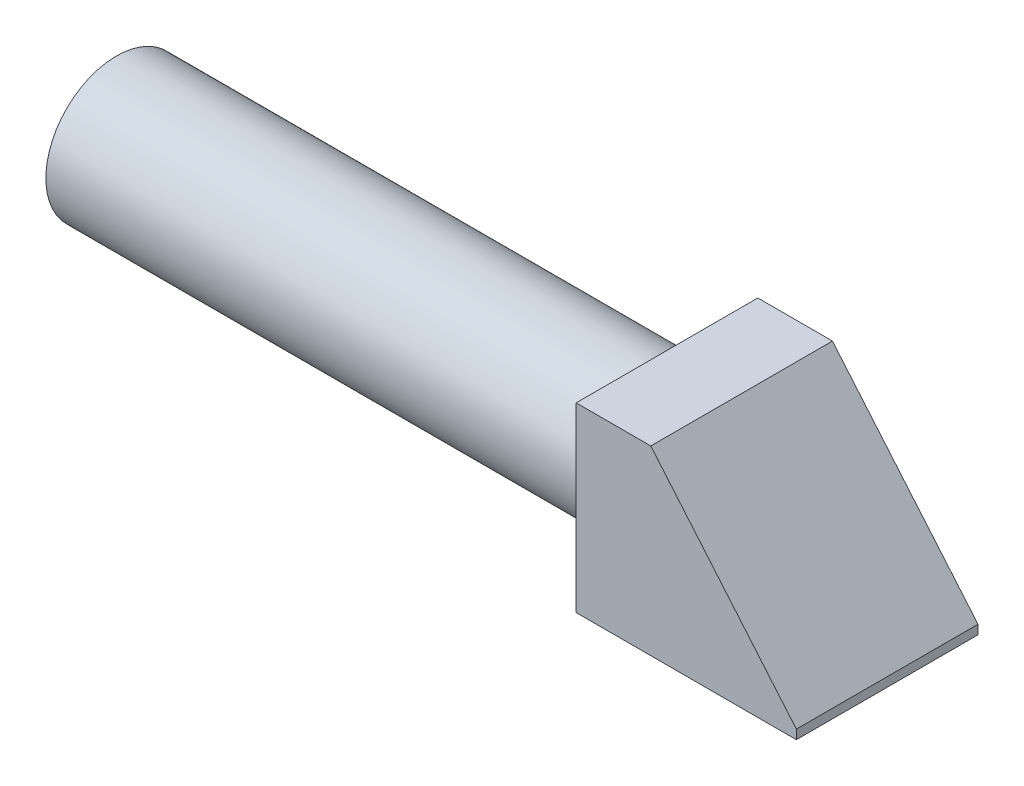
ISO-10303-21;
HEADER;
FILE_DESCRIPTION(('STEP AP214'),'2;1');
FILE_NAME('part.step','',(''),(''),'','','');
FILE_SCHEMA(('AUTOMOTIVE_DESIGN { 1 0 10303 214 1 1 1 1 }'));
ENDSEC;
DATA;
#1=APPLICATION_CONTEXT('core data for automotive mechanical design processes');
#2=APPLICATION_PROTOCOL_DEFINITION('international standard','automotive_design',2000,#1);
#3=PRODUCT_CONTEXT('',#1,'mechanical');
#4=PRODUCT('Part','Part','',(#3));
#5=PRODUCT_RELATED_PRODUCT_CATEGORY('part','',(#4));
#6=PRODUCT_DEFINITION_FORMATION('','',#4);
#7=PRODUCT_DEFINITION_CONTEXT('part definition',#1,'design');
#8=PRODUCT_DEFINITION('design','',#6,#7);
#9=PRODUCT_DEFINITION_SHAPE('','',#8);
#10=(LENGTH_UNIT() NAMED_UNIT(*) SI_UNIT(.MILLI.,.METRE.));
#11=(NAMED_UNIT(*) PLANE_ANGLE_UNIT() SI_UNIT($,.RADIAN.));
#12=(NAMED_UNIT(*) SI_UNIT($,.STERADIAN.) SOLID_ANGLE_UNIT());
#13=UNCERTAINTY_MEASURE_WITH_UNIT(LENGTH_MEASURE(1.E-05),#10,'distance_accuracy_value','');
#14=(GEOMETRIC_REPRESENTATION_CONTEXT(3) GLOBAL_UNCERTAINTY_ASSIGNED_CONTEXT((#13)) GLOBAL_UNIT_ASSIGNED_CONTEXT((#10,
#11,#12)) REPRESENTATION_CONTEXT('',''));
#15=CARTESIAN_POINT('',(0.,0.,0.));
#16=DIRECTION('',(0.,0.,1.));
#17=DIRECTION('',(1.,0.,0.));
#18=AXIS2_PLACEMENT_3D('',#15,#16,#17);
#19=CARTESIAN_POINT('',(30.,0.,0.));
#20=DIRECTION('',(-1.,0.,0.));
#21=DIRECTION('',(0.,0.,1.));
#22=AXIS2_PLACEMENT_3D('',#19,#20,#21);
#23=CYLINDRICAL_SURFACE('',#22,3.85);
#24=CARTESIAN_POINT('',(0.,0.,0.));
#25=DIRECTION('',(1.,0.,0.));
#26=DIRECTION('',(0.,0.,-1.));
#27=AXIS2_PLACEMENT_3D('',#24,#25,#26);
#28=CIRCLE('',#27,3.85);
#29=CARTESIAN_POINT('',(0.,0.,-3.85));
#30=VERTEX_POINT('',#29);
#31=EDGE_CURVE('E39',#30,#30,#28,.T.);
#32=ORIENTED_EDGE('',*,*,#31,.T.);
#33=EDGE_LOOP('',(#32));
#34=FACE_BOUND('',#33,.T.);
#35=CARTESIAN_POINT('',(29.,0.,0.));
#36=DIRECTION('',(1.,0.,0.));
#37=DIRECTION('',(0.,0.,-1.));
#38=AXIS2_PLACEMENT_3D('',#35,#36,#37);
#39=CIRCLE('',#38,3.85);
#40=CARTESIAN_POINT('',(29.,0.,-3.85));
#41=VERTEX_POINT('',#40);
#42=EDGE_CURVE('E115',#41,#41,#39,.T.);
#43=ORIENTED_EDGE('',*,*,#42,.F.);
#44=EDGE_LOOP('',(#43));
#45=FACE_BOUND('',#44,.T.);
#46=ADVANCED_FACE('F32',(#34,#45),#23,.T.);
#47=CARTESIAN_POINT('',(0.,0.,0.));
#48=DIRECTION('',(1.,0.,0.));
#49=DIRECTION('',(0.,0.,-1.));
#50=AXIS2_PLACEMENT_3D('',#47,#48,#49);
#51=PLANE('',#50);
#52=ORIENTED_EDGE('',*,*,#31,.F.);
#53=EDGE_LOOP('',(#52));
#54=FACE_BOUND('',#53,.T.);
#55=ADVANCED_FACE('F124',(#54),#51,.F.);
#56=CARTESIAN_POINT('',(29.,0.,0.));
#57=DIRECTION('',(1.,0.,0.));
#58=DIRECTION('',(0.,0.,-1.));
#59=AXIS2_PLACEMENT_3D('',#56,#57,#58);
#60=PLANE('',#59);
#61=CARTESIAN_POINT('',(29.,0.,0.));
#62=DIRECTION('',(1.,0.,0.));
#63=DIRECTION('',(0.,0.,-1.));
#64=AXIS2_PLACEMENT_3D('',#61,#62,#63);
#65=CIRCLE('',#64,3.25);
#66=CARTESIAN_POINT('',(29.,0.,-3.25));
#67=VERTEX_POINT('',#66);
#68=EDGE_CURVE('E112',#67,#67,#65,.T.);
#69=ORIENTED_EDGE('',*,*,#68,.F.);
#70=EDGE_LOOP('',(#69));
#71=FACE_BOUND('',#70,.T.);
#72=ORIENTED_EDGE('',*,*,#42,.T.);
#73=EDGE_LOOP('',(#72));
#74=FACE_BOUND('',#73,.T.);
#75=ADVANCED_FACE('F126',(#71,#74),#60,.T.);
#76=CARTESIAN_POINT('',(29.,0.,0.));
#77=DIRECTION('',(1.,0.,0.));
#78=DIRECTION('',(0.,0.,-1.));
#79=AXIS2_PLACEMENT_3D('',#76,#77,#78);
#80=CYLINDRICAL_SURFACE('',#79,3.25);
#81=ORIENTED_EDGE('',*,*,#68,.T.);
#82=EDGE_LOOP('',(#81));
#83=FACE_BOUND('',#82,.T.);
#84=CARTESIAN_POINT('',(30.,0.,0.));
#85=DIRECTION('',(1.,0.,0.));
#86=DIRECTION('',(0.,0.,-1.));
#87=AXIS2_PLACEMENT_3D('',#84,#85,#86);
#88=CIRCLE('',#87,3.25);
#89=CARTESIAN_POINT('',(30.,0.,-3.25));
#90=VERTEX_POINT('',#89);
#91=EDGE_CURVE('E111',#90,#90,#88,.T.);
#92=ORIENTED_EDGE('',*,*,#91,.F.);
#93=EDGE_LOOP('',(#92));
#94=FACE_BOUND('',#93,.T.);
#95=ADVANCED_FACE('F131',(#83,#94),#80,.T.);
#96=CARTESIAN_POINT('',(42.,-4.95,-4.95));
#97=DIRECTION('',(0.,0.,1.));
#98=DIRECTION('',(1.,0.,0.));
#99=AXIS2_PLACEMENT_3D('',#96,#97,#98);
#100=PLANE('',#99);
#101=DIRECTION('',(-1.,0.,0.));
#102=VECTOR('',#101,1.);
#103=CARTESIAN_POINT('',(42.,4.95,-4.95));
#104=LINE('',#103,#102);
#105=CARTESIAN_POINT('',(34.0671568778905,4.95,-4.95));
#106=VERTEX_POINT('',#105);
#107=CARTESIAN_POINT('',(30.,4.95,-4.95));
#108=VERTEX_POINT('',#107);
#109=EDGE_CURVE('E109',#106,#108,#104,.T.);
#110=ORIENTED_EDGE('',*,*,#109,.F.);
#111=DIRECTION('',(0.644946595293455,-0.764227642276423,0.));
#112=VECTOR('',#111,1.);
#113=CARTESIAN_POINT('',(42.2464430079577,-4.74202194460969,-4.95));
#114=LINE('',#113,#112);
#115=CARTESIAN_POINT('',(42.,-4.45,-4.95));
#116=VERTEX_POINT('',#115);
#117=EDGE_CURVE('E97',#106,#116,#114,.T.);
#118=ORIENTED_EDGE('',*,*,#117,.T.);
#119=DIRECTION('',(0.,1.,0.));
#120=VECTOR('',#119,1.);
#121=CARTESIAN_POINT('',(42.,-4.95,-4.95));
#122=LINE('',#121,#120);
#123=CARTESIAN_POINT('',(42.,-4.95,-4.95));
#124=VERTEX_POINT('',#123);
#125=EDGE_CURVE('E83',#124,#116,#122,.T.);
#126=ORIENTED_EDGE('',*,*,#125,.F.);
#127=DIRECTION('',(-1.,0.,0.));
#128=VECTOR('',#127,1.);
#129=CARTESIAN_POINT('',(42.,-4.95,-4.95));
#130=LINE('',#129,#128);
#131=CARTESIAN_POINT('',(30.,-4.95,-4.95));
#132=VERTEX_POINT('',#131);
#133=EDGE_CURVE('E76',#124,#132,#130,.T.);
#134=ORIENTED_EDGE('',*,*,#133,.T.);
#135=DIRECTION('',(0.,1.,0.));
#136=VECTOR('',#135,1.);
#137=CARTESIAN_POINT('',(30.,-4.95,-4.95));
#138=LINE('',#137,#136);
#139=EDGE_CURVE('E90',#132,#108,#138,.T.);
#140=ORIENTED_EDGE('',*,*,#139,.T.);
#141=EDGE_LOOP('',(#110,#118,#126,#134,#140));
#142=FACE_BOUND('',#141,.T.);
#143=ADVANCED_FACE('F89',(#142),#100,.F.);
#144=CARTESIAN_POINT('',(42.,4.95,4.95));
#145=DIRECTION('',(0.,-1.,0.));
#146=DIRECTION('',(0.,0.,-1.));
#147=AXIS2_PLACEMENT_3D('',#144,#145,#146);
#148=PLANE('',#147);
#149=DIRECTION('',(-1.,0.,0.));
#150=VECTOR('',#149,1.);
#151=CARTESIAN_POINT('',(42.,4.95,4.95));
#152=LINE('',#151,#150);
#153=CARTESIAN_POINT('',(34.0671568778905,4.95,4.95));
#154=VERTEX_POINT('',#153);
#155=CARTESIAN_POINT('',(30.,4.95,4.95));
#156=VERTEX_POINT('',#155);
#157=EDGE_CURVE('E107',#154,#156,#152,.T.);
#158=ORIENTED_EDGE('',*,*,#157,.F.);
#159=DIRECTION('',(0.,0.,1.));
#160=VECTOR('',#159,1.);
#161=CARTESIAN_POINT('',(34.0671568778905,4.95,-7.05));
#162=LINE('',#161,#160);
#163=EDGE_CURVE('E100',#106,#154,#162,.T.);
#164=ORIENTED_EDGE('',*,*,#163,.F.);
#165=ORIENTED_EDGE('',*,*,#109,.T.);
#166=DIRECTION('',(0.,0.,1.));
#167=VECTOR('',#166,1.);
#168=CARTESIAN_POINT('',(30.,4.95,4.95));
#169=LINE('',#168,#167);
#170=EDGE_CURVE('E96',#108,#156,#169,.T.);
#171=ORIENTED_EDGE('',*,*,#170,.T.);
#172=EDGE_LOOP('',(#158,#164,#165,#171));
#173=FACE_BOUND('',#172,.T.);
#174=ADVANCED_FACE('F140',(#173),#148,.F.);
#175=CARTESIAN_POINT('',(42.,-4.95,4.95));
#176=DIRECTION('',(0.,0.,-1.));
#177=DIRECTION('',(-1.,0.,0.));
#178=AXIS2_PLACEMENT_3D('',#175,#176,#177);
#179=PLANE('',#178);
#180=DIRECTION('',(0.,-1.,0.));
#181=VECTOR('',#180,1.);
#182=CARTESIAN_POINT('',(42.,-4.95,4.95));
#183=LINE('',#182,#181);
#184=CARTESIAN_POINT('',(42.,-4.45,4.95));
#185=VERTEX_POINT('',#184);
#186=CARTESIAN_POINT('',(42.,-4.95,4.95));
#187=VERTEX_POINT('',#186);
#188=EDGE_CURVE('E168',#185,#187,#183,.T.);
#189=ORIENTED_EDGE('',*,*,#188,.F.);
#190=DIRECTION('',(0.644946595293455,-0.764227642276423,0.));
#191=VECTOR('',#190,1.);
#192=CARTESIAN_POINT('',(34.0671568778905,4.95,4.95));
#193=LINE('',#192,#191);
#194=EDGE_CURVE('E46',#154,#185,#193,.T.);
#195=ORIENTED_EDGE('',*,*,#194,.F.);
#196=ORIENTED_EDGE('',*,*,#157,.T.);
#197=DIRECTION('',(0.,-1.,0.));
#198=VECTOR('',#197,1.);
#199=CARTESIAN_POINT('',(30.,-4.95,4.95));
#200=LINE('',#199,#198);
#201=CARTESIAN_POINT('',(30.,-4.95,4.95));
#202=VERTEX_POINT('',#201);
#203=EDGE_CURVE('E84',#156,#202,#200,.T.);
#204=ORIENTED_EDGE('',*,*,#203,.T.);
#205=DIRECTION('',(-1.,0.,0.));
#206=VECTOR('',#205,1.);
#207=CARTESIAN_POINT('',(42.,-4.95,4.95));
#208=LINE('',#207,#206);
#209=EDGE_CURVE('E79',#187,#202,#208,.T.);
#210=ORIENTED_EDGE('',*,*,#209,.F.);
#211=EDGE_LOOP('',(#189,#195,#196,#204,#210));
#212=FACE_BOUND('',#211,.T.);
#213=ADVANCED_FACE('F143',(#212),#179,.F.);
#214=CARTESIAN_POINT('',(42.,-4.95,4.95));
#215=DIRECTION('',(0.,1.,0.));
#216=DIRECTION('',(0.,0.,1.));
#217=AXIS2_PLACEMENT_3D('',#214,#215,#216);
#218=PLANE('',#217);
#219=DIRECTION('',(0.,0.,-1.));
#220=VECTOR('',#219,1.);
#221=CARTESIAN_POINT('',(30.,-4.95,4.95));
#222=LINE('',#221,#220);
#223=EDGE_CURVE('E73',#202,#132,#222,.T.);
#224=ORIENTED_EDGE('',*,*,#223,.T.);
#225=ORIENTED_EDGE('',*,*,#133,.F.);
#226=DIRECTION('',(0.,0.,-1.));
#227=VECTOR('',#226,1.);
#228=CARTESIAN_POINT('',(42.,-4.95,4.95));
#229=LINE('',#228,#227);
#230=EDGE_CURVE('E54',#187,#124,#229,.T.);
#231=ORIENTED_EDGE('',*,*,#230,.F.);
#232=ORIENTED_EDGE('',*,*,#209,.T.);
#233=EDGE_LOOP('',(#224,#225,#231,#232));
#234=FACE_BOUND('',#233,.T.);
#235=ADVANCED_FACE('F75',(#234),#218,.F.);
#236=CARTESIAN_POINT('',(42.,0.,0.));
#237=DIRECTION('',(-1.,0.,0.));
#238=DIRECTION('',(0.,0.,1.));
#239=AXIS2_PLACEMENT_3D('',#236,#237,#238);
#240=PLANE('',#239);
#241=ORIENTED_EDGE('',*,*,#125,.T.);
#242=DIRECTION('',(0.,0.,1.));
#243=VECTOR('',#242,1.);
#244=CARTESIAN_POINT('',(42.,-4.45,0.));
#245=LINE('',#244,#243);
#246=EDGE_CURVE('E11',#116,#185,#245,.T.);
#247=ORIENTED_EDGE('',*,*,#246,.T.);
#248=ORIENTED_EDGE('',*,*,#188,.T.);
#249=ORIENTED_EDGE('',*,*,#230,.T.);
#250=EDGE_LOOP('',(#241,#247,#248,#249));
#251=FACE_BOUND('',#250,.T.);
#252=ADVANCED_FACE('F150',(#251),#240,.F.);
#253=CARTESIAN_POINT('',(30.,0.,0.));
#254=DIRECTION('',(-1.,0.,0.));
#255=DIRECTION('',(0.,0.,1.));
#256=AXIS2_PLACEMENT_3D('',#253,#254,#255);
#257=PLANE('',#256);
#258=ORIENTED_EDGE('',*,*,#91,.T.);
#259=EDGE_LOOP('',(#258));
#260=FACE_BOUND('',#259,.T.);
#261=ORIENTED_EDGE('',*,*,#139,.F.);
#262=ORIENTED_EDGE('',*,*,#223,.F.);
#263=ORIENTED_EDGE('',*,*,#203,.F.);
#264=ORIENTED_EDGE('',*,*,#170,.F.);
#265=EDGE_LOOP('',(#261,#262,#263,#264));
#266=FACE_BOUND('',#265,.T.);
#267=ADVANCED_FACE('F94',(#260,#266),#257,.T.);
#268=CARTESIAN_POINT('',(34.0671568778905,4.95,-7.05));
#269=DIRECTION('',(-0.764227642276423,-0.644946595293455,0.));
#270=DIRECTION('',(0.644946595293455,-0.764227642276423,0.));
#271=AXIS2_PLACEMENT_3D('',#268,#269,#270);
#272=PLANE('',#271);
#273=ORIENTED_EDGE('',*,*,#163,.T.);
#274=ORIENTED_EDGE('',*,*,#194,.T.);
#275=ORIENTED_EDGE('',*,*,#246,.F.);
#276=ORIENTED_EDGE('',*,*,#117,.F.);
#277=EDGE_LOOP('',(#273,#274,#275,#276));
#278=FACE_BOUND('',#277,.T.);
#279=ADVANCED_FACE('F153',(#278),#272,.F.);
#280=CLOSED_SHELL('',(#46,#55,#75,#95,#143,#174,#213,#235,#252,#267,#279));
#281=MANIFOLD_SOLID_BREP('B2',#280);
#282=ADVANCED_BREP_SHAPE_REPRESENTATION('',(#18,#281),#14);
#283=SHAPE_DEFINITION_REPRESENTATION(#9,#282);
ENDSEC;
END-ISO-10303-21;
